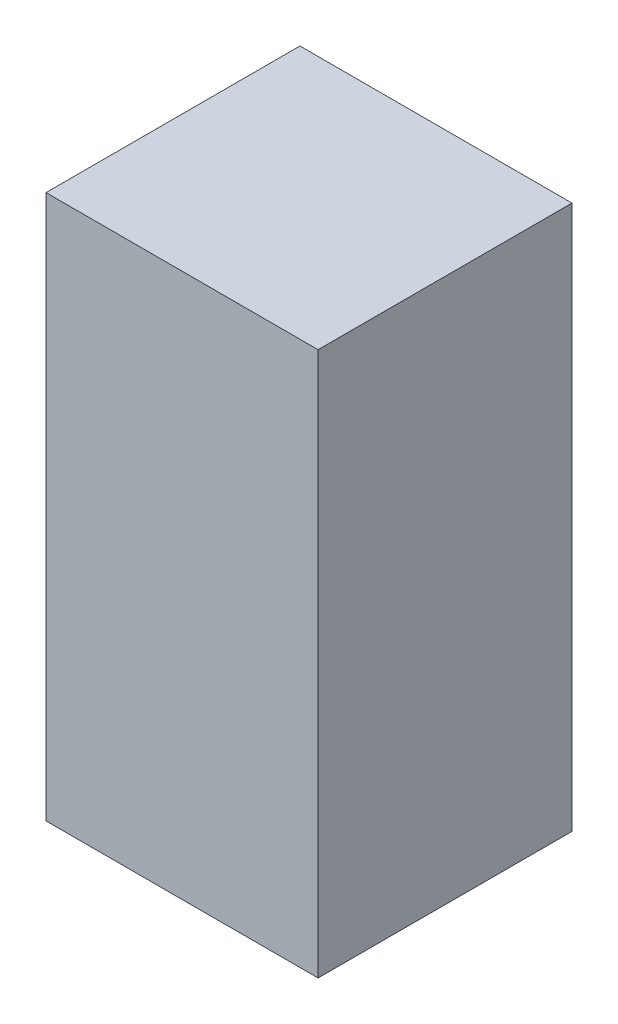
ISO-10303-21;
HEADER;
FILE_DESCRIPTION(('STEP AP214'),'2;1');
FILE_NAME('part.step','',(''),(''),'','','');
FILE_SCHEMA(('AUTOMOTIVE_DESIGN { 1 0 10303 214 1 1 1 1 }'));
ENDSEC;
DATA;
#1=APPLICATION_CONTEXT('core data for automotive mechanical design processes');
#2=APPLICATION_PROTOCOL_DEFINITION('international standard','automotive_design',2000,#1);
#3=PRODUCT_CONTEXT('',#1,'mechanical');
#4=PRODUCT('Part','Part','',(#3));
#5=PRODUCT_RELATED_PRODUCT_CATEGORY('part','',(#4));
#6=PRODUCT_DEFINITION_FORMATION('','',#4);
#7=PRODUCT_DEFINITION_CONTEXT('part definition',#1,'design');
#8=PRODUCT_DEFINITION('design','',#6,#7);
#9=PRODUCT_DEFINITION_SHAPE('','',#8);
#10=(LENGTH_UNIT() NAMED_UNIT(*) SI_UNIT(.MILLI.,.METRE.));
#11=(NAMED_UNIT(*) PLANE_ANGLE_UNIT() SI_UNIT($,.RADIAN.));
#12=(NAMED_UNIT(*) SI_UNIT($,.STERADIAN.) SOLID_ANGLE_UNIT());
#13=UNCERTAINTY_MEASURE_WITH_UNIT(LENGTH_MEASURE(1.E-05),#10,'distance_accuracy_value','');
#14=(GEOMETRIC_REPRESENTATION_CONTEXT(3) GLOBAL_UNCERTAINTY_ASSIGNED_CONTEXT((#13)) GLOBAL_UNIT_ASSIGNED_CONTEXT((#10,
#11,#12)) REPRESENTATION_CONTEXT('',''));
#15=CARTESIAN_POINT('',(0.,0.,0.));
#16=DIRECTION('',(0.,0.,1.));
#17=DIRECTION('',(1.,0.,0.));
#18=AXIS2_PLACEMENT_3D('',#15,#16,#17);
#19=CARTESIAN_POINT('',(-0.75000104,1.49999954,1.39999974));
#20=DIRECTION('',(0.,0.,-1.));
#21=DIRECTION('',(-1.,0.,0.));
#22=AXIS2_PLACEMENT_3D('',#19,#20,#21);
#23=PLANE('',#22);
#24=DIRECTION('',(1.,0.,0.));
#25=VECTOR('',#24,1.);
#26=CARTESIAN_POINT('',(-0.75000104,-1.49999954,1.39999974));
#27=LINE('',#26,#25);
#28=CARTESIAN_POINT('',(-0.75000104,-1.49999954,1.39999974));
#29=VERTEX_POINT('',#28);
#30=CARTESIAN_POINT('',(0.75000104,-1.49999954,1.39999974));
#31=VERTEX_POINT('',#30);
#32=EDGE_CURVE('E54',#29,#31,#27,.T.);
#33=ORIENTED_EDGE('',*,*,#32,.T.);
#34=DIRECTION('',(0.,1.,0.));
#35=VECTOR('',#34,1.);
#36=CARTESIAN_POINT('',(0.75000104,-1.49999954,1.39999974));
#37=LINE('',#36,#35);
#38=CARTESIAN_POINT('',(0.75000104,1.49999954,1.39999974));
#39=VERTEX_POINT('',#38);
#40=EDGE_CURVE('E56',#31,#39,#37,.T.);
#41=ORIENTED_EDGE('',*,*,#40,.T.);
#42=DIRECTION('',(1.,0.,0.));
#43=VECTOR('',#42,1.);
#44=CARTESIAN_POINT('',(0.75000104,1.49999954,1.39999974));
#45=LINE('',#44,#43);
#46=CARTESIAN_POINT('',(-0.75000104,1.49999954,1.39999974));
#47=VERTEX_POINT('',#46);
#48=EDGE_CURVE('E19',#39,#47,#45,.F.);
#49=ORIENTED_EDGE('',*,*,#48,.T.);
#50=DIRECTION('',(0.,1.,0.));
#51=VECTOR('',#50,1.);
#52=CARTESIAN_POINT('',(-0.75000104,1.49999954,1.39999974));
#53=LINE('',#52,#51);
#54=EDGE_CURVE('E79',#47,#29,#53,.F.);
#55=ORIENTED_EDGE('',*,*,#54,.T.);
#56=EDGE_LOOP('',(#33,#41,#49,#55));
#57=FACE_BOUND('',#56,.T.);
#58=ADVANCED_FACE('F16',(#57),#23,.F.);
#59=CARTESIAN_POINT('',(0.75000104,1.49999954,0.));
#60=DIRECTION('',(0.,-1.,0.));
#61=DIRECTION('',(0.,0.,-1.));
#62=AXIS2_PLACEMENT_3D('',#59,#60,#61);
#63=PLANE('',#62);
#64=DIRECTION('',(0.,0.,-1.));
#65=VECTOR('',#64,1.);
#66=CARTESIAN_POINT('',(-0.75000104,1.49999954,0.));
#67=LINE('',#66,#65);
#68=CARTESIAN_POINT('',(-0.75000104,1.49999954,0.));
#69=VERTEX_POINT('',#68);
#70=EDGE_CURVE('E67',#69,#47,#67,.F.);
#71=ORIENTED_EDGE('',*,*,#70,.T.);
#72=ORIENTED_EDGE('',*,*,#48,.F.);
#73=DIRECTION('',(0.,0.,1.));
#74=VECTOR('',#73,1.);
#75=CARTESIAN_POINT('',(0.75000104,1.49999954,0.));
#76=LINE('',#75,#74);
#77=CARTESIAN_POINT('',(0.75000104,1.49999954,0.));
#78=VERTEX_POINT('',#77);
#79=EDGE_CURVE('E62',#39,#78,#76,.F.);
#80=ORIENTED_EDGE('',*,*,#79,.T.);
#81=DIRECTION('',(-1.,0.,0.));
#82=VECTOR('',#81,1.);
#83=CARTESIAN_POINT('',(-0.75000104,1.49999954,0.));
#84=LINE('',#83,#82);
#85=EDGE_CURVE('E82',#69,#78,#84,.F.);
#86=ORIENTED_EDGE('',*,*,#85,.F.);
#87=EDGE_LOOP('',(#71,#72,#80,#86));
#88=FACE_BOUND('',#87,.T.);
#89=ADVANCED_FACE('F64',(#88),#63,.F.);
#90=CARTESIAN_POINT('',(0.75000104,-1.49999954,0.));
#91=DIRECTION('',(-1.,0.,0.));
#92=DIRECTION('',(0.,0.,1.));
#93=AXIS2_PLACEMENT_3D('',#90,#91,#92);
#94=PLANE('',#93);
#95=ORIENTED_EDGE('',*,*,#79,.F.);
#96=ORIENTED_EDGE('',*,*,#40,.F.);
#97=DIRECTION('',(0.,0.,1.));
#98=VECTOR('',#97,1.);
#99=CARTESIAN_POINT('',(0.75000104,-1.49999954,0.));
#100=LINE('',#99,#98);
#101=CARTESIAN_POINT('',(0.75000104,-1.49999954,0.));
#102=VERTEX_POINT('',#101);
#103=EDGE_CURVE('E74',#31,#102,#100,.F.);
#104=ORIENTED_EDGE('',*,*,#103,.T.);
#105=DIRECTION('',(0.,1.,0.));
#106=VECTOR('',#105,1.);
#107=CARTESIAN_POINT('',(0.75000104,1.49999954,0.));
#108=LINE('',#107,#106);
#109=EDGE_CURVE('E71',#78,#102,#108,.F.);
#110=ORIENTED_EDGE('',*,*,#109,.F.);
#111=EDGE_LOOP('',(#95,#96,#104,#110));
#112=FACE_BOUND('',#111,.T.);
#113=ADVANCED_FACE('F69',(#112),#94,.F.);
#114=CARTESIAN_POINT('',(-0.75000104,-1.49999954,0.));
#115=DIRECTION('',(0.,1.,0.));
#116=DIRECTION('',(0.,0.,1.));
#117=AXIS2_PLACEMENT_3D('',#114,#115,#116);
#118=PLANE('',#117);
#119=ORIENTED_EDGE('',*,*,#103,.F.);
#120=ORIENTED_EDGE('',*,*,#32,.F.);
#121=DIRECTION('',(0.,0.,-1.));
#122=VECTOR('',#121,1.);
#123=CARTESIAN_POINT('',(-0.75000104,-1.49999954,0.));
#124=LINE('',#123,#122);
#125=CARTESIAN_POINT('',(-0.75000104,-1.49999954,0.));
#126=VERTEX_POINT('',#125);
#127=EDGE_CURVE('E34',#29,#126,#124,.T.);
#128=ORIENTED_EDGE('',*,*,#127,.T.);
#129=DIRECTION('',(-1.,0.,0.));
#130=VECTOR('',#129,1.);
#131=CARTESIAN_POINT('',(-0.75000104,-1.49999954,0.));
#132=LINE('',#131,#130);
#133=EDGE_CURVE('E25',#102,#126,#132,.T.);
#134=ORIENTED_EDGE('',*,*,#133,.F.);
#135=EDGE_LOOP('',(#119,#120,#128,#134));
#136=FACE_BOUND('',#135,.T.);
#137=ADVANCED_FACE('F88',(#136),#118,.F.);
#138=CARTESIAN_POINT('',(-0.75000104,1.49999954,0.));
#139=DIRECTION('',(1.,0.,0.));
#140=DIRECTION('',(0.,0.,-1.));
#141=AXIS2_PLACEMENT_3D('',#138,#139,#140);
#142=PLANE('',#141);
#143=ORIENTED_EDGE('',*,*,#127,.F.);
#144=ORIENTED_EDGE('',*,*,#54,.F.);
#145=ORIENTED_EDGE('',*,*,#70,.F.);
#146=DIRECTION('',(0.,1.,0.));
#147=VECTOR('',#146,1.);
#148=CARTESIAN_POINT('',(-0.75000104,1.49999954,0.));
#149=LINE('',#148,#147);
#150=EDGE_CURVE('E11',#126,#69,#149,.T.);
#151=ORIENTED_EDGE('',*,*,#150,.F.);
#152=EDGE_LOOP('',(#143,#144,#145,#151));
#153=FACE_BOUND('',#152,.T.);
#154=ADVANCED_FACE('F90',(#153),#142,.F.);
#155=CARTESIAN_POINT('',(-0.75000104,1.49999954,0.));
#156=DIRECTION('',(0.,0.,-1.));
#157=DIRECTION('',(-1.,0.,0.));
#158=AXIS2_PLACEMENT_3D('',#155,#156,#157);
#159=PLANE('',#158);
#160=ORIENTED_EDGE('',*,*,#133,.T.);
#161=ORIENTED_EDGE('',*,*,#150,.T.);
#162=ORIENTED_EDGE('',*,*,#85,.T.);
#163=ORIENTED_EDGE('',*,*,#109,.T.);
#164=EDGE_LOOP('',(#160,#161,#162,#163));
#165=FACE_BOUND('',#164,.T.);
#166=ADVANCED_FACE('F87',(#165),#159,.T.);
#167=CLOSED_SHELL('',(#58,#89,#113,#137,#154,#166));
#168=MANIFOLD_SOLID_BREP('B1',#167);
#169=ADVANCED_BREP_SHAPE_REPRESENTATION('',(#18,#168),#14);
#170=SHAPE_DEFINITION_REPRESENTATION(#9,#169);
ENDSEC;
END-ISO-10303-21;
